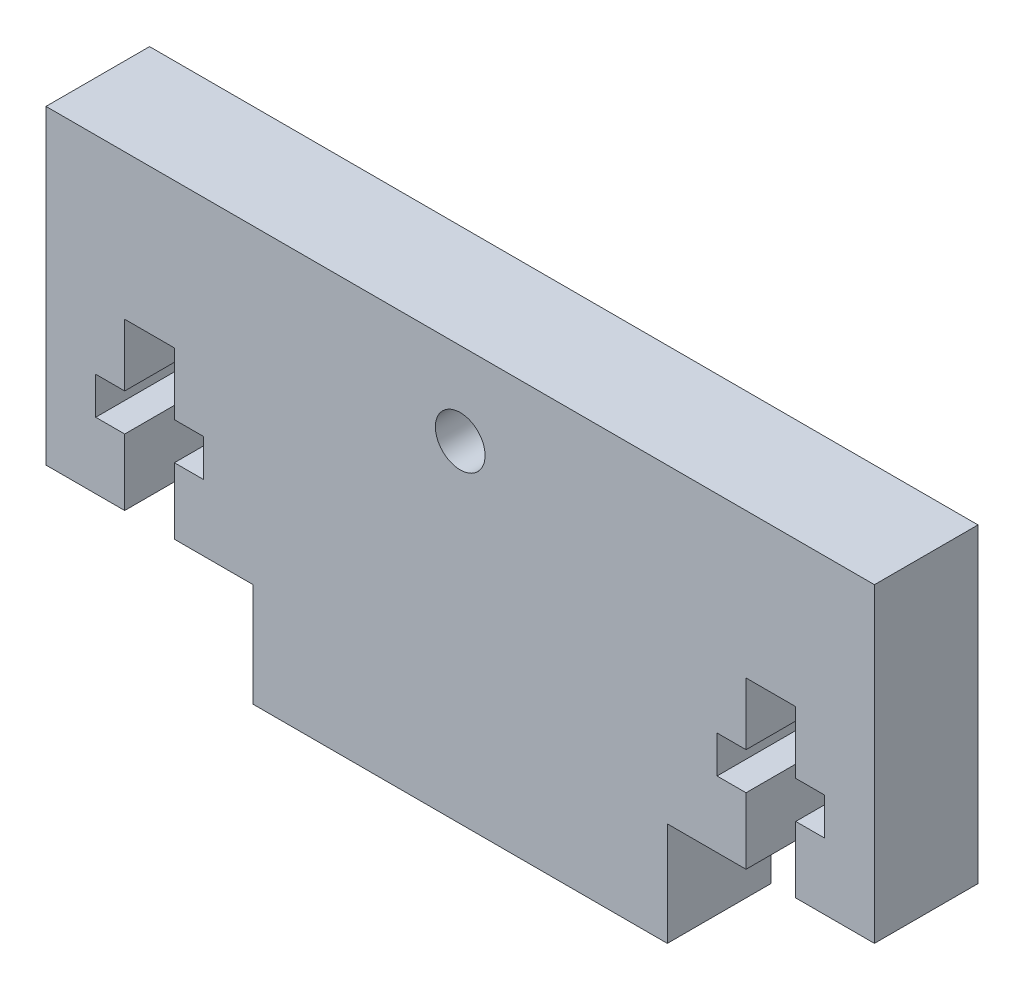
ISO-10303-21;
HEADER;
FILE_DESCRIPTION(('STEP AP214'),'2;1');
FILE_NAME('part.step','',(''),(''),'','','');
FILE_SCHEMA(('AUTOMOTIVE_DESIGN { 1 0 10303 214 1 1 1 1 }'));
ENDSEC;
DATA;
#1=APPLICATION_CONTEXT('core data for automotive mechanical design processes');
#2=APPLICATION_PROTOCOL_DEFINITION('international standard','automotive_design',2000,#1);
#3=PRODUCT_CONTEXT('',#1,'mechanical');
#4=PRODUCT('Part','Part','',(#3));
#5=PRODUCT_RELATED_PRODUCT_CATEGORY('part','',(#4));
#6=PRODUCT_DEFINITION_FORMATION('','',#4);
#7=PRODUCT_DEFINITION_CONTEXT('part definition',#1,'design');
#8=PRODUCT_DEFINITION('design','',#6,#7);
#9=PRODUCT_DEFINITION_SHAPE('','',#8);
#10=(LENGTH_UNIT() NAMED_UNIT(*) SI_UNIT(.MILLI.,.METRE.));
#11=(NAMED_UNIT(*) PLANE_ANGLE_UNIT() SI_UNIT($,.RADIAN.));
#12=(NAMED_UNIT(*) SI_UNIT($,.STERADIAN.) SOLID_ANGLE_UNIT());
#13=UNCERTAINTY_MEASURE_WITH_UNIT(LENGTH_MEASURE(1.E-05),#10,'distance_accuracy_value','');
#14=(GEOMETRIC_REPRESENTATION_CONTEXT(3) GLOBAL_UNCERTAINTY_ASSIGNED_CONTEXT((#13)) GLOBAL_UNIT_ASSIGNED_CONTEXT((#10,
#11,#12)) REPRESENTATION_CONTEXT('',''));
#15=CARTESIAN_POINT('',(0.,0.,0.));
#16=DIRECTION('',(0.,0.,1.));
#17=DIRECTION('',(1.,0.,0.));
#18=AXIS2_PLACEMENT_3D('',#15,#16,#17);
#19=CARTESIAN_POINT('',(0.,0.,6.35));
#20=DIRECTION('',(0.,1.,0.));
#21=DIRECTION('',(0.,0.,1.));
#22=AXIS2_PLACEMENT_3D('',#19,#20,#21);
#23=PLANE('',#22);
#24=DIRECTION('',(1.,0.,0.));
#25=VECTOR('',#24,1.);
#26=CARTESIAN_POINT('',(0.,0.,0.));
#27=LINE('',#26,#25);
#28=CARTESIAN_POINT('',(12.7,0.,0.));
#29=VERTEX_POINT('',#28);
#30=CARTESIAN_POINT('',(38.1,0.,0.));
#31=VERTEX_POINT('',#30);
#32=EDGE_CURVE('E340',#29,#31,#27,.T.);
#33=ORIENTED_EDGE('',*,*,#32,.T.);
#34=DIRECTION('',(0.,0.,-1.));
#35=VECTOR('',#34,1.);
#36=CARTESIAN_POINT('',(38.1,0.,6.35));
#37=LINE('',#36,#35);
#38=CARTESIAN_POINT('',(38.1,0.,6.35));
#39=VERTEX_POINT('',#38);
#40=EDGE_CURVE('E11',#39,#31,#37,.T.);
#41=ORIENTED_EDGE('',*,*,#40,.F.);
#42=DIRECTION('',(1.,0.,0.));
#43=VECTOR('',#42,1.);
#44=CARTESIAN_POINT('',(0.,0.,6.35));
#45=LINE('',#44,#43);
#46=CARTESIAN_POINT('',(12.7,0.,6.35));
#47=VERTEX_POINT('',#46);
#48=EDGE_CURVE('E332',#47,#39,#45,.T.);
#49=ORIENTED_EDGE('',*,*,#48,.F.);
#50=DIRECTION('',(0.,0.,-1.));
#51=VECTOR('',#50,1.);
#52=CARTESIAN_POINT('',(12.7,0.,6.35));
#53=LINE('',#52,#51);
#54=EDGE_CURVE('E51',#47,#29,#53,.T.);
#55=ORIENTED_EDGE('',*,*,#54,.T.);
#56=EDGE_LOOP('',(#33,#41,#49,#55));
#57=FACE_BOUND('',#56,.T.);
#58=ADVANCED_FACE('F35',(#57),#23,.F.);
#59=CARTESIAN_POINT('',(38.1,0.,6.35));
#60=DIRECTION('',(-1.,0.,0.));
#61=DIRECTION('',(0.,0.,1.));
#62=AXIS2_PLACEMENT_3D('',#59,#60,#61);
#63=PLANE('',#62);
#64=DIRECTION('',(0.,1.,0.));
#65=VECTOR('',#64,1.);
#66=CARTESIAN_POINT('',(38.1,0.,0.));
#67=LINE('',#66,#65);
#68=CARTESIAN_POINT('',(38.1,6.35000000000001,0.));
#69=VERTEX_POINT('',#68);
#70=EDGE_CURVE('E343',#31,#69,#67,.T.);
#71=ORIENTED_EDGE('',*,*,#70,.T.);
#72=DIRECTION('',(0.,0.,-1.));
#73=VECTOR('',#72,1.);
#74=CARTESIAN_POINT('',(38.1,6.35000000000001,6.35));
#75=LINE('',#74,#73);
#76=CARTESIAN_POINT('',(38.1,6.35000000000001,6.35));
#77=VERTEX_POINT('',#76);
#78=EDGE_CURVE('E43',#77,#69,#75,.T.);
#79=ORIENTED_EDGE('',*,*,#78,.F.);
#80=DIRECTION('',(0.,1.,0.));
#81=VECTOR('',#80,1.);
#82=CARTESIAN_POINT('',(38.1,0.,6.35));
#83=LINE('',#82,#81);
#84=EDGE_CURVE('E162',#39,#77,#83,.T.);
#85=ORIENTED_EDGE('',*,*,#84,.F.);
#86=ORIENTED_EDGE('',*,*,#40,.T.);
#87=EDGE_LOOP('',(#71,#79,#85,#86));
#88=FACE_BOUND('',#87,.T.);
#89=ADVANCED_FACE('F478',(#88),#63,.F.);
#90=CARTESIAN_POINT('',(0.,6.35000000000001,6.35));
#91=DIRECTION('',(0.,-1.,0.));
#92=DIRECTION('',(1.,0.,0.));
#93=AXIS2_PLACEMENT_3D('',#90,#91,#92);
#94=PLANE('',#93);
#95=DIRECTION('',(-1.,0.,0.));
#96=VECTOR('',#95,1.);
#97=CARTESIAN_POINT('',(0.,6.35000000000001,0.));
#98=LINE('',#97,#96);
#99=CARTESIAN_POINT('',(42.926,6.35000000000001,0.));
#100=VERTEX_POINT('',#99);
#101=EDGE_CURVE('E347',#100,#69,#98,.T.);
#102=ORIENTED_EDGE('',*,*,#101,.F.);
#103=DIRECTION('',(0.,0.,-1.));
#104=VECTOR('',#103,1.);
#105=CARTESIAN_POINT('',(42.926,6.35000000000001,6.35));
#106=LINE('',#105,#104);
#107=CARTESIAN_POINT('',(42.926,6.35000000000001,6.35));
#108=VERTEX_POINT('',#107);
#109=EDGE_CURVE('E473',#108,#100,#106,.T.);
#110=ORIENTED_EDGE('',*,*,#109,.F.);
#111=DIRECTION('',(-1.,0.,0.));
#112=VECTOR('',#111,1.);
#113=CARTESIAN_POINT('',(0.,6.35000000000001,6.35));
#114=LINE('',#113,#112);
#115=EDGE_CURVE('E328',#108,#77,#114,.T.);
#116=ORIENTED_EDGE('',*,*,#115,.T.);
#117=ORIENTED_EDGE('',*,*,#78,.T.);
#118=EDGE_LOOP('',(#102,#110,#116,#117));
#119=FACE_BOUND('',#118,.T.);
#120=ADVANCED_FACE('F476',(#119),#94,.T.);
#121=CARTESIAN_POINT('',(42.926,0.,6.35));
#122=DIRECTION('',(-1.,0.,0.));
#123=DIRECTION('',(0.,0.,1.));
#124=AXIS2_PLACEMENT_3D('',#121,#122,#123);
#125=PLANE('',#124);
#126=DIRECTION('',(0.,1.,0.));
#127=VECTOR('',#126,1.);
#128=CARTESIAN_POINT('',(42.926,0.,0.));
#129=LINE('',#128,#127);
#130=CARTESIAN_POINT('',(42.926,10.414,0.));
#131=VERTEX_POINT('',#130);
#132=EDGE_CURVE('E353',#100,#131,#129,.T.);
#133=ORIENTED_EDGE('',*,*,#132,.T.);
#134=DIRECTION('',(0.,0.,-1.));
#135=VECTOR('',#134,1.);
#136=CARTESIAN_POINT('',(42.926,10.414,6.35));
#137=LINE('',#136,#135);
#138=CARTESIAN_POINT('',(42.926,10.414,6.35));
#139=VERTEX_POINT('',#138);
#140=EDGE_CURVE('E471',#139,#131,#137,.T.);
#141=ORIENTED_EDGE('',*,*,#140,.F.);
#142=DIRECTION('',(0.,1.,0.));
#143=VECTOR('',#142,1.);
#144=CARTESIAN_POINT('',(42.926,0.,6.35));
#145=LINE('',#144,#143);
#146=EDGE_CURVE('E326',#108,#139,#145,.T.);
#147=ORIENTED_EDGE('',*,*,#146,.F.);
#148=ORIENTED_EDGE('',*,*,#109,.T.);
#149=EDGE_LOOP('',(#133,#141,#147,#148));
#150=FACE_BOUND('',#149,.T.);
#151=ADVANCED_FACE('F485',(#150),#125,.F.);
#152=CARTESIAN_POINT('',(0.,10.4140000000001,6.35));
#153=DIRECTION('',(0.,1.,0.));
#154=DIRECTION('',(-1.,0.,0.));
#155=AXIS2_PLACEMENT_3D('',#152,#153,#154);
#156=PLANE('',#155);
#157=DIRECTION('',(1.,0.,0.));
#158=VECTOR('',#157,1.);
#159=CARTESIAN_POINT('',(0.,10.4140000000001,0.));
#160=LINE('',#159,#158);
#161=CARTESIAN_POINT('',(41.148,10.414,0.));
#162=VERTEX_POINT('',#161);
#163=EDGE_CURVE('E357',#162,#131,#160,.T.);
#164=ORIENTED_EDGE('',*,*,#163,.F.);
#165=DIRECTION('',(0.,0.,-1.));
#166=VECTOR('',#165,1.);
#167=CARTESIAN_POINT('',(41.148,10.414,6.35));
#168=LINE('',#167,#166);
#169=CARTESIAN_POINT('',(41.148,10.414,6.35));
#170=VERTEX_POINT('',#169);
#171=EDGE_CURVE('E469',#170,#162,#168,.T.);
#172=ORIENTED_EDGE('',*,*,#171,.F.);
#173=DIRECTION('',(1.,0.,0.));
#174=VECTOR('',#173,1.);
#175=CARTESIAN_POINT('',(0.,10.4140000000001,6.35));
#176=LINE('',#175,#174);
#177=EDGE_CURVE('E323',#170,#139,#176,.T.);
#178=ORIENTED_EDGE('',*,*,#177,.T.);
#179=ORIENTED_EDGE('',*,*,#140,.T.);
#180=EDGE_LOOP('',(#164,#172,#178,#179));
#181=FACE_BOUND('',#180,.T.);
#182=ADVANCED_FACE('F502',(#181),#156,.T.);
#183=CARTESIAN_POINT('',(41.148,0.,6.35));
#184=DIRECTION('',(1.,0.,0.));
#185=DIRECTION('',(0.,0.,-1.));
#186=AXIS2_PLACEMENT_3D('',#183,#184,#185);
#187=PLANE('',#186);
#188=DIRECTION('',(0.,-1.,0.));
#189=VECTOR('',#188,1.);
#190=CARTESIAN_POINT('',(41.148,0.,0.));
#191=LINE('',#190,#189);
#192=CARTESIAN_POINT('',(41.148,12.7,0.));
#193=VERTEX_POINT('',#192);
#194=EDGE_CURVE('E361',#193,#162,#191,.T.);
#195=ORIENTED_EDGE('',*,*,#194,.F.);
#196=DIRECTION('',(0.,0.,-1.));
#197=VECTOR('',#196,1.);
#198=CARTESIAN_POINT('',(41.148,12.7,6.35));
#199=LINE('',#198,#197);
#200=CARTESIAN_POINT('',(41.148,12.7,6.35));
#201=VERTEX_POINT('',#200);
#202=EDGE_CURVE('E467',#201,#193,#199,.T.);
#203=ORIENTED_EDGE('',*,*,#202,.F.);
#204=DIRECTION('',(0.,-1.,0.));
#205=VECTOR('',#204,1.);
#206=CARTESIAN_POINT('',(41.148,0.,6.35));
#207=LINE('',#206,#205);
#208=EDGE_CURVE('E320',#201,#170,#207,.T.);
#209=ORIENTED_EDGE('',*,*,#208,.T.);
#210=ORIENTED_EDGE('',*,*,#171,.T.);
#211=EDGE_LOOP('',(#195,#203,#209,#210));
#212=FACE_BOUND('',#211,.T.);
#213=ADVANCED_FACE('F498',(#212),#187,.T.);
#214=CARTESIAN_POINT('',(0.,12.6999999999999,6.35));
#215=DIRECTION('',(0.,1.,0.));
#216=DIRECTION('',(-1.,0.,0.));
#217=AXIS2_PLACEMENT_3D('',#214,#215,#216);
#218=PLANE('',#217);
#219=DIRECTION('',(1.,0.,0.));
#220=VECTOR('',#219,1.);
#221=CARTESIAN_POINT('',(0.,12.6999999999999,0.));
#222=LINE('',#221,#220);
#223=CARTESIAN_POINT('',(42.926,12.7,0.));
#224=VERTEX_POINT('',#223);
#225=EDGE_CURVE('E365',#193,#224,#222,.T.);
#226=ORIENTED_EDGE('',*,*,#225,.T.);
#227=DIRECTION('',(0.,0.,-1.));
#228=VECTOR('',#227,1.);
#229=CARTESIAN_POINT('',(42.926,12.7,6.35));
#230=LINE('',#229,#228);
#231=CARTESIAN_POINT('',(42.926,12.7,6.35));
#232=VERTEX_POINT('',#231);
#233=EDGE_CURVE('E464',#232,#224,#230,.T.);
#234=ORIENTED_EDGE('',*,*,#233,.F.);
#235=DIRECTION('',(1.,0.,0.));
#236=VECTOR('',#235,1.);
#237=CARTESIAN_POINT('',(0.,12.6999999999999,6.35));
#238=LINE('',#237,#236);
#239=EDGE_CURVE('E318',#201,#232,#238,.T.);
#240=ORIENTED_EDGE('',*,*,#239,.F.);
#241=ORIENTED_EDGE('',*,*,#202,.T.);
#242=EDGE_LOOP('',(#226,#234,#240,#241));
#243=FACE_BOUND('',#242,.T.);
#244=ADVANCED_FACE('F501',(#243),#218,.F.);
#245=CARTESIAN_POINT('',(42.926,16.51,0.));
#246=VERTEX_POINT('',#245);
#247=EDGE_CURVE('E358',#224,#246,#129,.T.);
#248=ORIENTED_EDGE('',*,*,#247,.T.);
#249=DIRECTION('',(0.,0.,-1.));
#250=VECTOR('',#249,1.);
#251=CARTESIAN_POINT('',(42.926,16.51,6.35));
#252=LINE('',#251,#250);
#253=CARTESIAN_POINT('',(42.926,16.51,6.35));
#254=VERTEX_POINT('',#253);
#255=EDGE_CURVE('E461',#254,#246,#252,.T.);
#256=ORIENTED_EDGE('',*,*,#255,.F.);
#257=EDGE_CURVE('E317',#232,#254,#145,.T.);
#258=ORIENTED_EDGE('',*,*,#257,.F.);
#259=ORIENTED_EDGE('',*,*,#233,.T.);
#260=EDGE_LOOP('',(#248,#256,#258,#259));
#261=FACE_BOUND('',#260,.T.);
#262=ADVANCED_FACE('F504',(#261),#125,.F.);
#263=CARTESIAN_POINT('',(0.,16.51,6.35));
#264=DIRECTION('',(0.,1.,0.));
#265=DIRECTION('',(0.,0.,1.));
#266=AXIS2_PLACEMENT_3D('',#263,#264,#265);
#267=PLANE('',#266);
#268=DIRECTION('',(1.,0.,0.));
#269=VECTOR('',#268,1.);
#270=CARTESIAN_POINT('',(0.,16.51,0.));
#271=LINE('',#270,#269);
#272=CARTESIAN_POINT('',(45.974,16.51,0.));
#273=VERTEX_POINT('',#272);
#274=EDGE_CURVE('E368',#246,#273,#271,.T.);
#275=ORIENTED_EDGE('',*,*,#274,.T.);
#276=DIRECTION('',(0.,0.,-1.));
#277=VECTOR('',#276,1.);
#278=CARTESIAN_POINT('',(45.974,16.51,6.35));
#279=LINE('',#278,#277);
#280=CARTESIAN_POINT('',(45.974,16.51,6.35));
#281=VERTEX_POINT('',#280);
#282=EDGE_CURVE('E459',#281,#273,#279,.T.);
#283=ORIENTED_EDGE('',*,*,#282,.F.);
#284=DIRECTION('',(1.,0.,0.));
#285=VECTOR('',#284,1.);
#286=CARTESIAN_POINT('',(0.,16.51,6.35));
#287=LINE('',#286,#285);
#288=EDGE_CURVE('E314',#254,#281,#287,.T.);
#289=ORIENTED_EDGE('',*,*,#288,.F.);
#290=ORIENTED_EDGE('',*,*,#255,.T.);
#291=EDGE_LOOP('',(#275,#283,#289,#290));
#292=FACE_BOUND('',#291,.T.);
#293=ADVANCED_FACE('F507',(#292),#267,.F.);
#294=CARTESIAN_POINT('',(45.974,0.,6.35));
#295=DIRECTION('',(-1.,0.,0.));
#296=DIRECTION('',(0.,0.,1.));
#297=AXIS2_PLACEMENT_3D('',#294,#295,#296);
#298=PLANE('',#297);
#299=DIRECTION('',(0.,1.,0.));
#300=VECTOR('',#299,1.);
#301=CARTESIAN_POINT('',(45.974,0.,0.));
#302=LINE('',#301,#300);
#303=CARTESIAN_POINT('',(45.974,12.7,0.));
#304=VERTEX_POINT('',#303);
#305=EDGE_CURVE('E371',#304,#273,#302,.T.);
#306=ORIENTED_EDGE('',*,*,#305,.F.);
#307=DIRECTION('',(0.,0.,-1.));
#308=VECTOR('',#307,1.);
#309=CARTESIAN_POINT('',(45.974,12.7,6.35));
#310=LINE('',#309,#308);
#311=CARTESIAN_POINT('',(45.974,12.7,6.35));
#312=VERTEX_POINT('',#311);
#313=EDGE_CURVE('E457',#312,#304,#310,.T.);
#314=ORIENTED_EDGE('',*,*,#313,.F.);
#315=DIRECTION('',(0.,1.,0.));
#316=VECTOR('',#315,1.);
#317=CARTESIAN_POINT('',(45.974,0.,6.35));
#318=LINE('',#317,#316);
#319=EDGE_CURVE('E311',#312,#281,#318,.T.);
#320=ORIENTED_EDGE('',*,*,#319,.T.);
#321=ORIENTED_EDGE('',*,*,#282,.T.);
#322=EDGE_LOOP('',(#306,#314,#320,#321));
#323=FACE_BOUND('',#322,.T.);
#324=ADVANCED_FACE('F511',(#323),#298,.T.);
#325=CARTESIAN_POINT('',(47.752,12.7,0.));
#326=VERTEX_POINT('',#325);
#327=EDGE_CURVE('E367',#304,#326,#222,.T.);
#328=ORIENTED_EDGE('',*,*,#327,.T.);
#329=DIRECTION('',(0.,0.,-1.));
#330=VECTOR('',#329,1.);
#331=CARTESIAN_POINT('',(47.752,12.7,6.35));
#332=LINE('',#331,#330);
#333=CARTESIAN_POINT('',(47.752,12.7,6.35));
#334=VERTEX_POINT('',#333);
#335=EDGE_CURVE('E454',#334,#326,#332,.T.);
#336=ORIENTED_EDGE('',*,*,#335,.F.);
#337=EDGE_CURVE('E310',#312,#334,#238,.T.);
#338=ORIENTED_EDGE('',*,*,#337,.F.);
#339=ORIENTED_EDGE('',*,*,#313,.T.);
#340=EDGE_LOOP('',(#328,#336,#338,#339));
#341=FACE_BOUND('',#340,.T.);
#342=ADVANCED_FACE('F513',(#341),#218,.F.);
#343=CARTESIAN_POINT('',(47.752,0.,6.35));
#344=DIRECTION('',(1.,0.,0.));
#345=DIRECTION('',(0.,0.,-1.));
#346=AXIS2_PLACEMENT_3D('',#343,#344,#345);
#347=PLANE('',#346);
#348=DIRECTION('',(0.,-1.,0.));
#349=VECTOR('',#348,1.);
#350=CARTESIAN_POINT('',(47.752,0.,0.));
#351=LINE('',#350,#349);
#352=CARTESIAN_POINT('',(47.752,10.414,0.));
#353=VERTEX_POINT('',#352);
#354=EDGE_CURVE('E375',#326,#353,#351,.T.);
#355=ORIENTED_EDGE('',*,*,#354,.T.);
#356=DIRECTION('',(0.,0.,-1.));
#357=VECTOR('',#356,1.);
#358=CARTESIAN_POINT('',(47.752,10.414,6.35));
#359=LINE('',#358,#357);
#360=CARTESIAN_POINT('',(47.752,10.414,6.35));
#361=VERTEX_POINT('',#360);
#362=EDGE_CURVE('E452',#361,#353,#359,.T.);
#363=ORIENTED_EDGE('',*,*,#362,.F.);
#364=DIRECTION('',(0.,-1.,0.));
#365=VECTOR('',#364,1.);
#366=CARTESIAN_POINT('',(47.752,0.,6.35));
#367=LINE('',#366,#365);
#368=EDGE_CURVE('E307',#334,#361,#367,.T.);
#369=ORIENTED_EDGE('',*,*,#368,.F.);
#370=ORIENTED_EDGE('',*,*,#335,.T.);
#371=EDGE_LOOP('',(#355,#363,#369,#370));
#372=FACE_BOUND('',#371,.T.);
#373=ADVANCED_FACE('F516',(#372),#347,.F.);
#374=CARTESIAN_POINT('',(45.974,10.414,0.));
#375=VERTEX_POINT('',#374);
#376=EDGE_CURVE('E362',#375,#353,#160,.T.);
#377=ORIENTED_EDGE('',*,*,#376,.F.);
#378=DIRECTION('',(0.,0.,-1.));
#379=VECTOR('',#378,1.);
#380=CARTESIAN_POINT('',(45.974,10.414,6.35));
#381=LINE('',#380,#379);
#382=CARTESIAN_POINT('',(45.974,10.414,6.35));
#383=VERTEX_POINT('',#382);
#384=EDGE_CURVE('E450',#383,#375,#381,.T.);
#385=ORIENTED_EDGE('',*,*,#384,.F.);
#386=EDGE_CURVE('E309',#383,#361,#176,.T.);
#387=ORIENTED_EDGE('',*,*,#386,.T.);
#388=ORIENTED_EDGE('',*,*,#362,.T.);
#389=EDGE_LOOP('',(#377,#385,#387,#388));
#390=FACE_BOUND('',#389,.T.);
#391=ADVANCED_FACE('F520',(#390),#156,.T.);
#392=CARTESIAN_POINT('',(45.974,6.35000000000001,0.));
#393=VERTEX_POINT('',#392);
#394=EDGE_CURVE('E374',#393,#375,#302,.T.);
#395=ORIENTED_EDGE('',*,*,#394,.F.);
#396=DIRECTION('',(0.,0.,-1.));
#397=VECTOR('',#396,1.);
#398=CARTESIAN_POINT('',(45.974,6.35000000000001,6.35));
#399=LINE('',#398,#397);
#400=CARTESIAN_POINT('',(45.974,6.35000000000001,6.35));
#401=VERTEX_POINT('',#400);
#402=EDGE_CURVE('E448',#401,#393,#399,.T.);
#403=ORIENTED_EDGE('',*,*,#402,.F.);
#404=EDGE_CURVE('E315',#401,#383,#318,.T.);
#405=ORIENTED_EDGE('',*,*,#404,.T.);
#406=ORIENTED_EDGE('',*,*,#384,.T.);
#407=EDGE_LOOP('',(#395,#403,#405,#406));
#408=FACE_BOUND('',#407,.T.);
#409=ADVANCED_FACE('F524',(#408),#298,.T.);
#410=CARTESIAN_POINT('',(50.8,6.35000000000001,0.));
#411=VERTEX_POINT('',#410);
#412=EDGE_CURVE('E354',#411,#393,#98,.T.);
#413=ORIENTED_EDGE('',*,*,#412,.F.);
#414=DIRECTION('',(0.,0.,-1.));
#415=VECTOR('',#414,1.);
#416=CARTESIAN_POINT('',(50.8,6.35000000000001,6.35));
#417=LINE('',#416,#415);
#418=CARTESIAN_POINT('',(50.8,6.35000000000001,6.35));
#419=VERTEX_POINT('',#418);
#420=EDGE_CURVE('E446',#419,#411,#417,.T.);
#421=ORIENTED_EDGE('',*,*,#420,.F.);
#422=EDGE_CURVE('E306',#419,#401,#114,.T.);
#423=ORIENTED_EDGE('',*,*,#422,.T.);
#424=ORIENTED_EDGE('',*,*,#402,.T.);
#425=EDGE_LOOP('',(#413,#421,#423,#424));
#426=FACE_BOUND('',#425,.T.);
#427=ADVANCED_FACE('F496',(#426),#94,.T.);
#428=CARTESIAN_POINT('',(50.8,0.,6.35));
#429=DIRECTION('',(1.,0.,0.));
#430=DIRECTION('',(0.,1.,0.));
#431=AXIS2_PLACEMENT_3D('',#428,#429,#430);
#432=PLANE('',#431);
#433=DIRECTION('',(0.,-1.,0.));
#434=VECTOR('',#433,1.);
#435=CARTESIAN_POINT('',(50.8,0.,0.));
#436=LINE('',#435,#434);
#437=CARTESIAN_POINT('',(50.8,25.4,0.));
#438=VERTEX_POINT('',#437);
#439=EDGE_CURVE('E378',#438,#411,#436,.T.);
#440=ORIENTED_EDGE('',*,*,#439,.F.);
#441=DIRECTION('',(0.,0.,-1.));
#442=VECTOR('',#441,1.);
#443=CARTESIAN_POINT('',(50.8,25.4,6.35));
#444=LINE('',#443,#442);
#445=CARTESIAN_POINT('',(50.8,25.4,6.35));
#446=VERTEX_POINT('',#445);
#447=EDGE_CURVE('E444',#446,#438,#444,.T.);
#448=ORIENTED_EDGE('',*,*,#447,.F.);
#449=DIRECTION('',(0.,-1.,0.));
#450=VECTOR('',#449,1.);
#451=CARTESIAN_POINT('',(50.8,0.,6.35));
#452=LINE('',#451,#450);
#453=EDGE_CURVE('E303',#446,#419,#452,.T.);
#454=ORIENTED_EDGE('',*,*,#453,.T.);
#455=ORIENTED_EDGE('',*,*,#420,.T.);
#456=EDGE_LOOP('',(#440,#448,#454,#455));
#457=FACE_BOUND('',#456,.T.);
#458=ADVANCED_FACE('F530',(#457),#432,.T.);
#459=CARTESIAN_POINT('',(0.,25.4,6.35));
#460=DIRECTION('',(0.,1.,0.));
#461=DIRECTION('',(-1.,0.,0.));
#462=AXIS2_PLACEMENT_3D('',#459,#460,#461);
#463=PLANE('',#462);
#464=DIRECTION('',(1.,0.,0.));
#465=VECTOR('',#464,1.);
#466=CARTESIAN_POINT('',(0.,25.4,0.));
#467=LINE('',#466,#465);
#468=CARTESIAN_POINT('',(0.,25.4,0.));
#469=VERTEX_POINT('',#468);
#470=EDGE_CURVE('E381',#469,#438,#467,.T.);
#471=ORIENTED_EDGE('',*,*,#470,.F.);
#472=DIRECTION('',(0.,0.,-1.));
#473=VECTOR('',#472,1.);
#474=CARTESIAN_POINT('',(0.,25.4,6.35));
#475=LINE('',#474,#473);
#476=CARTESIAN_POINT('',(0.,25.4,6.35));
#477=VERTEX_POINT('',#476);
#478=EDGE_CURVE('E442',#477,#469,#475,.T.);
#479=ORIENTED_EDGE('',*,*,#478,.F.);
#480=DIRECTION('',(1.,0.,0.));
#481=VECTOR('',#480,1.);
#482=CARTESIAN_POINT('',(0.,25.4,6.35));
#483=LINE('',#482,#481);
#484=EDGE_CURVE('E300',#477,#446,#483,.T.);
#485=ORIENTED_EDGE('',*,*,#484,.T.);
#486=ORIENTED_EDGE('',*,*,#447,.T.);
#487=EDGE_LOOP('',(#471,#479,#485,#486));
#488=FACE_BOUND('',#487,.T.);
#489=ADVANCED_FACE('F534',(#488),#463,.T.);
#490=CARTESIAN_POINT('',(0.,0.,6.35));
#491=DIRECTION('',(1.,0.,0.));
#492=DIRECTION('',(0.,1.,0.));
#493=AXIS2_PLACEMENT_3D('',#490,#491,#492);
#494=PLANE('',#493);
#495=DIRECTION('',(0.,-1.,0.));
#496=VECTOR('',#495,1.);
#497=CARTESIAN_POINT('',(0.,0.,0.));
#498=LINE('',#497,#496);
#499=CARTESIAN_POINT('',(0.,6.35000000000001,0.));
#500=VERTEX_POINT('',#499);
#501=EDGE_CURVE('E384',#469,#500,#498,.T.);
#502=ORIENTED_EDGE('',*,*,#501,.T.);
#503=DIRECTION('',(0.,0.,-1.));
#504=VECTOR('',#503,1.);
#505=CARTESIAN_POINT('',(0.,6.35000000000001,6.35));
#506=LINE('',#505,#504);
#507=CARTESIAN_POINT('',(0.,6.35000000000001,6.35));
#508=VERTEX_POINT('',#507);
#509=EDGE_CURVE('E439',#508,#500,#506,.T.);
#510=ORIENTED_EDGE('',*,*,#509,.F.);
#511=DIRECTION('',(0.,-1.,0.));
#512=VECTOR('',#511,1.);
#513=CARTESIAN_POINT('',(0.,0.,6.35));
#514=LINE('',#513,#512);
#515=EDGE_CURVE('E298',#477,#508,#514,.T.);
#516=ORIENTED_EDGE('',*,*,#515,.F.);
#517=ORIENTED_EDGE('',*,*,#478,.T.);
#518=EDGE_LOOP('',(#502,#510,#516,#517));
#519=FACE_BOUND('',#518,.T.);
#520=ADVANCED_FACE('F538',(#519),#494,.F.);
#521=CARTESIAN_POINT('',(0.,6.35000000000001,6.35));
#522=DIRECTION('',(0.,1.,0.));
#523=DIRECTION('',(-1.,0.,0.));
#524=AXIS2_PLACEMENT_3D('',#521,#522,#523);
#525=PLANE('',#524);
#526=DIRECTION('',(1.,0.,0.));
#527=VECTOR('',#526,1.);
#528=CARTESIAN_POINT('',(0.,6.35000000000001,0.));
#529=LINE('',#528,#527);
#530=CARTESIAN_POINT('',(4.82599999999998,6.35000000000001,0.));
#531=VERTEX_POINT('',#530);
#532=EDGE_CURVE('E386',#500,#531,#529,.T.);
#533=ORIENTED_EDGE('',*,*,#532,.T.);
#534=DIRECTION('',(0.,0.,-1.));
#535=VECTOR('',#534,1.);
#536=CARTESIAN_POINT('',(4.82599999999998,6.35000000000001,6.35));
#537=LINE('',#536,#535);
#538=CARTESIAN_POINT('',(4.82599999999998,6.35000000000001,6.35));
#539=VERTEX_POINT('',#538);
#540=EDGE_CURVE('E436',#539,#531,#537,.T.);
#541=ORIENTED_EDGE('',*,*,#540,.F.);
#542=DIRECTION('',(1.,0.,0.));
#543=VECTOR('',#542,1.);
#544=CARTESIAN_POINT('',(0.,6.35000000000001,6.35));
#545=LINE('',#544,#543);
#546=EDGE_CURVE('E267',#508,#539,#545,.T.);
#547=ORIENTED_EDGE('',*,*,#546,.F.);
#548=ORIENTED_EDGE('',*,*,#509,.T.);
#549=EDGE_LOOP('',(#533,#541,#547,#548));
#550=FACE_BOUND('',#549,.T.);
#551=ADVANCED_FACE('F542',(#550),#525,.F.);
#552=CARTESIAN_POINT('',(4.82599999999998,0.,6.35));
#553=DIRECTION('',(-1.,0.,0.));
#554=DIRECTION('',(0.,0.,1.));
#555=AXIS2_PLACEMENT_3D('',#552,#553,#554);
#556=PLANE('',#555);
#557=DIRECTION('',(0.,1.,0.));
#558=VECTOR('',#557,1.);
#559=CARTESIAN_POINT('',(4.82599999999998,0.,0.));
#560=LINE('',#559,#558);
#561=CARTESIAN_POINT('',(4.82599999999998,10.414,0.));
#562=VERTEX_POINT('',#561);
#563=EDGE_CURVE('E388',#531,#562,#560,.T.);
#564=ORIENTED_EDGE('',*,*,#563,.T.);
#565=DIRECTION('',(0.,0.,-1.));
#566=VECTOR('',#565,1.);
#567=CARTESIAN_POINT('',(4.82599999999998,10.414,6.35));
#568=LINE('',#567,#566);
#569=CARTESIAN_POINT('',(4.82599999999998,10.414,6.35));
#570=VERTEX_POINT('',#569);
#571=EDGE_CURVE('E433',#570,#562,#568,.T.);
#572=ORIENTED_EDGE('',*,*,#571,.F.);
#573=DIRECTION('',(0.,1.,0.));
#574=VECTOR('',#573,1.);
#575=CARTESIAN_POINT('',(4.82599999999998,0.,6.35));
#576=LINE('',#575,#574);
#577=EDGE_CURVE('E292',#539,#570,#576,.T.);
#578=ORIENTED_EDGE('',*,*,#577,.F.);
#579=ORIENTED_EDGE('',*,*,#540,.T.);
#580=EDGE_LOOP('',(#564,#572,#578,#579));
#581=FACE_BOUND('',#580,.T.);
#582=ADVANCED_FACE('F555',(#581),#556,.F.);
#583=CARTESIAN_POINT('',(0.,10.414,6.35));
#584=DIRECTION('',(0.,-1.,0.));
#585=DIRECTION('',(1.,0.,0.));
#586=AXIS2_PLACEMENT_3D('',#583,#584,#585);
#587=PLANE('',#586);
#588=DIRECTION('',(-1.,0.,0.));
#589=VECTOR('',#588,1.);
#590=CARTESIAN_POINT('',(0.,10.414,0.));
#591=LINE('',#590,#589);
#592=CARTESIAN_POINT('',(3.04799999999998,10.414,0.));
#593=VERTEX_POINT('',#592);
#594=EDGE_CURVE('E391',#562,#593,#591,.T.);
#595=ORIENTED_EDGE('',*,*,#594,.T.);
#596=DIRECTION('',(0.,0.,-1.));
#597=VECTOR('',#596,1.);
#598=CARTESIAN_POINT('',(3.04799999999998,10.414,6.35));
#599=LINE('',#598,#597);
#600=CARTESIAN_POINT('',(3.04799999999998,10.414,6.35));
#601=VERTEX_POINT('',#600);
#602=EDGE_CURVE('E431',#601,#593,#599,.T.);
#603=ORIENTED_EDGE('',*,*,#602,.F.);
#604=DIRECTION('',(-1.,0.,0.));
#605=VECTOR('',#604,1.);
#606=CARTESIAN_POINT('',(0.,10.414,6.35));
#607=LINE('',#606,#605);
#608=EDGE_CURVE('E276',#570,#601,#607,.T.);
#609=ORIENTED_EDGE('',*,*,#608,.F.);
#610=ORIENTED_EDGE('',*,*,#571,.T.);
#611=EDGE_LOOP('',(#595,#603,#609,#610));
#612=FACE_BOUND('',#611,.T.);
#613=ADVANCED_FACE('F548',(#612),#587,.F.);
#614=CARTESIAN_POINT('',(3.04799999999998,0.,6.35));
#615=DIRECTION('',(1.,0.,0.));
#616=DIRECTION('',(0.,0.,-1.));
#617=AXIS2_PLACEMENT_3D('',#614,#615,#616);
#618=PLANE('',#617);
#619=DIRECTION('',(0.,-1.,0.));
#620=VECTOR('',#619,1.);
#621=CARTESIAN_POINT('',(3.04799999999998,0.,0.));
#622=LINE('',#621,#620);
#623=CARTESIAN_POINT('',(3.04799999999998,12.7,0.));
#624=VERTEX_POINT('',#623);
#625=EDGE_CURVE('E395',#624,#593,#622,.T.);
#626=ORIENTED_EDGE('',*,*,#625,.F.);
#627=DIRECTION('',(0.,0.,-1.));
#628=VECTOR('',#627,1.);
#629=CARTESIAN_POINT('',(3.04799999999998,12.7,6.35));
#630=LINE('',#629,#628);
#631=CARTESIAN_POINT('',(3.04799999999998,12.7,6.35));
#632=VERTEX_POINT('',#631);
#633=EDGE_CURVE('E429',#632,#624,#630,.T.);
#634=ORIENTED_EDGE('',*,*,#633,.F.);
#635=DIRECTION('',(0.,-1.,0.));
#636=VECTOR('',#635,1.);
#637=CARTESIAN_POINT('',(3.04799999999998,0.,6.35));
#638=LINE('',#637,#636);
#639=EDGE_CURVE('E295',#632,#601,#638,.T.);
#640=ORIENTED_EDGE('',*,*,#639,.T.);
#641=ORIENTED_EDGE('',*,*,#602,.T.);
#642=EDGE_LOOP('',(#626,#634,#640,#641));
#643=FACE_BOUND('',#642,.T.);
#644=ADVANCED_FACE('F544',(#643),#618,.T.);
#645=CARTESIAN_POINT('',(0.,12.7,6.35));
#646=DIRECTION('',(0.,-1.,0.));
#647=DIRECTION('',(1.,0.,0.));
#648=AXIS2_PLACEMENT_3D('',#645,#646,#647);
#649=PLANE('',#648);
#650=DIRECTION('',(-1.,0.,0.));
#651=VECTOR('',#650,1.);
#652=CARTESIAN_POINT('',(0.,12.7,0.));
#653=LINE('',#652,#651);
#654=CARTESIAN_POINT('',(4.82599999999998,12.7,0.));
#655=VERTEX_POINT('',#654);
#656=EDGE_CURVE('E399',#655,#624,#653,.T.);
#657=ORIENTED_EDGE('',*,*,#656,.F.);
#658=DIRECTION('',(0.,0.,-1.));
#659=VECTOR('',#658,1.);
#660=CARTESIAN_POINT('',(4.82599999999998,12.7,6.35));
#661=LINE('',#660,#659);
#662=CARTESIAN_POINT('',(4.82599999999998,12.7,6.35));
#663=VERTEX_POINT('',#662);
#664=EDGE_CURVE('E427',#663,#655,#661,.T.);
#665=ORIENTED_EDGE('',*,*,#664,.F.);
#666=DIRECTION('',(-1.,0.,0.));
#667=VECTOR('',#666,1.);
#668=CARTESIAN_POINT('',(0.,12.7,6.35));
#669=LINE('',#668,#667);
#670=EDGE_CURVE('E286',#663,#632,#669,.T.);
#671=ORIENTED_EDGE('',*,*,#670,.T.);
#672=ORIENTED_EDGE('',*,*,#633,.T.);
#673=EDGE_LOOP('',(#657,#665,#671,#672));
#674=FACE_BOUND('',#673,.T.);
#675=ADVANCED_FACE('F547',(#674),#649,.T.);
#676=CARTESIAN_POINT('',(4.82599999999998,16.51,0.));
#677=VERTEX_POINT('',#676);
#678=EDGE_CURVE('E392',#655,#677,#560,.T.);
#679=ORIENTED_EDGE('',*,*,#678,.T.);
#680=DIRECTION('',(0.,0.,-1.));
#681=VECTOR('',#680,1.);
#682=CARTESIAN_POINT('',(4.82599999999998,16.51,6.35));
#683=LINE('',#682,#681);
#684=CARTESIAN_POINT('',(4.82599999999998,16.51,6.35));
#685=VERTEX_POINT('',#684);
#686=EDGE_CURVE('E425',#685,#677,#683,.T.);
#687=ORIENTED_EDGE('',*,*,#686,.F.);
#688=EDGE_CURVE('E288',#663,#685,#576,.T.);
#689=ORIENTED_EDGE('',*,*,#688,.F.);
#690=ORIENTED_EDGE('',*,*,#664,.T.);
#691=EDGE_LOOP('',(#679,#687,#689,#690));
#692=FACE_BOUND('',#691,.T.);
#693=ADVANCED_FACE('F550',(#692),#556,.F.);
#694=CARTESIAN_POINT('',(0.,16.51,6.35));
#695=DIRECTION('',(0.,-1.,0.));
#696=DIRECTION('',(0.,0.,-1.));
#697=AXIS2_PLACEMENT_3D('',#694,#695,#696);
#698=PLANE('',#697);
#699=DIRECTION('',(-1.,0.,0.));
#700=VECTOR('',#699,1.);
#701=CARTESIAN_POINT('',(0.,16.51,0.));
#702=LINE('',#701,#700);
#703=CARTESIAN_POINT('',(7.87399999999999,16.51,0.));
#704=VERTEX_POINT('',#703);
#705=EDGE_CURVE('E403',#704,#677,#702,.T.);
#706=ORIENTED_EDGE('',*,*,#705,.F.);
#707=DIRECTION('',(0.,0.,-1.));
#708=VECTOR('',#707,1.);
#709=CARTESIAN_POINT('',(7.87399999999999,16.51,6.35));
#710=LINE('',#709,#708);
#711=CARTESIAN_POINT('',(7.87399999999999,16.51,6.35));
#712=VERTEX_POINT('',#711);
#713=EDGE_CURVE('E423',#712,#704,#710,.T.);
#714=ORIENTED_EDGE('',*,*,#713,.F.);
#715=DIRECTION('',(-1.,0.,0.));
#716=VECTOR('',#715,1.);
#717=CARTESIAN_POINT('',(0.,16.51,6.35));
#718=LINE('',#717,#716);
#719=EDGE_CURVE('E281',#712,#685,#718,.T.);
#720=ORIENTED_EDGE('',*,*,#719,.T.);
#721=ORIENTED_EDGE('',*,*,#686,.T.);
#722=EDGE_LOOP('',(#706,#714,#720,#721));
#723=FACE_BOUND('',#722,.T.);
#724=ADVANCED_FACE('F553',(#723),#698,.T.);
#725=CARTESIAN_POINT('',(7.87399999999999,0.,6.35));
#726=DIRECTION('',(-1.,0.,0.));
#727=DIRECTION('',(0.,0.,1.));
#728=AXIS2_PLACEMENT_3D('',#725,#726,#727);
#729=PLANE('',#728);
#730=DIRECTION('',(0.,1.,0.));
#731=VECTOR('',#730,1.);
#732=CARTESIAN_POINT('',(7.87399999999999,0.,0.));
#733=LINE('',#732,#731);
#734=CARTESIAN_POINT('',(7.87399999999999,12.7,0.));
#735=VERTEX_POINT('',#734);
#736=EDGE_CURVE('E406',#735,#704,#733,.T.);
#737=ORIENTED_EDGE('',*,*,#736,.F.);
#738=DIRECTION('',(0.,0.,-1.));
#739=VECTOR('',#738,1.);
#740=CARTESIAN_POINT('',(7.87399999999999,12.7,6.35));
#741=LINE('',#740,#739);
#742=CARTESIAN_POINT('',(7.87399999999999,12.7,6.35));
#743=VERTEX_POINT('',#742);
#744=EDGE_CURVE('E421',#743,#735,#741,.T.);
#745=ORIENTED_EDGE('',*,*,#744,.F.);
#746=DIRECTION('',(0.,1.,0.));
#747=VECTOR('',#746,1.);
#748=CARTESIAN_POINT('',(7.87399999999999,0.,6.35));
#749=LINE('',#748,#747);
#750=EDGE_CURVE('E273',#743,#712,#749,.T.);
#751=ORIENTED_EDGE('',*,*,#750,.T.);
#752=ORIENTED_EDGE('',*,*,#713,.T.);
#753=EDGE_LOOP('',(#737,#745,#751,#752));
#754=FACE_BOUND('',#753,.T.);
#755=ADVANCED_FACE('F558',(#754),#729,.T.);
#756=CARTESIAN_POINT('',(9.65199999999998,12.7,0.));
#757=VERTEX_POINT('',#756);
#758=EDGE_CURVE('E402',#757,#735,#653,.T.);
#759=ORIENTED_EDGE('',*,*,#758,.F.);
#760=DIRECTION('',(0.,0.,-1.));
#761=VECTOR('',#760,1.);
#762=CARTESIAN_POINT('',(9.65199999999998,12.7,6.35));
#763=LINE('',#762,#761);
#764=CARTESIAN_POINT('',(9.65199999999998,12.7,6.35));
#765=VERTEX_POINT('',#764);
#766=EDGE_CURVE('E419',#765,#757,#763,.T.);
#767=ORIENTED_EDGE('',*,*,#766,.F.);
#768=EDGE_CURVE('E280',#765,#743,#669,.T.);
#769=ORIENTED_EDGE('',*,*,#768,.T.);
#770=ORIENTED_EDGE('',*,*,#744,.T.);
#771=EDGE_LOOP('',(#759,#767,#769,#770));
#772=FACE_BOUND('',#771,.T.);
#773=ADVANCED_FACE('F559',(#772),#649,.T.);
#774=CARTESIAN_POINT('',(9.65199999999998,0.,6.35));
#775=DIRECTION('',(1.,0.,0.));
#776=DIRECTION('',(0.,0.,-1.));
#777=AXIS2_PLACEMENT_3D('',#774,#775,#776);
#778=PLANE('',#777);
#779=DIRECTION('',(0.,-1.,0.));
#780=VECTOR('',#779,1.);
#781=CARTESIAN_POINT('',(9.65199999999998,0.,0.));
#782=LINE('',#781,#780);
#783=CARTESIAN_POINT('',(9.65199999999998,10.414,0.));
#784=VERTEX_POINT('',#783);
#785=EDGE_CURVE('E409',#757,#784,#782,.T.);
#786=ORIENTED_EDGE('',*,*,#785,.T.);
#787=DIRECTION('',(0.,0.,-1.));
#788=VECTOR('',#787,1.);
#789=CARTESIAN_POINT('',(9.65199999999998,10.414,6.35));
#790=LINE('',#789,#788);
#791=CARTESIAN_POINT('',(9.65199999999998,10.414,6.35));
#792=VERTEX_POINT('',#791);
#793=EDGE_CURVE('E416',#792,#784,#790,.T.);
#794=ORIENTED_EDGE('',*,*,#793,.F.);
#795=DIRECTION('',(0.,-1.,0.));
#796=VECTOR('',#795,1.);
#797=CARTESIAN_POINT('',(9.65199999999998,0.,6.35));
#798=LINE('',#797,#796);
#799=EDGE_CURVE('E274',#765,#792,#798,.T.);
#800=ORIENTED_EDGE('',*,*,#799,.F.);
#801=ORIENTED_EDGE('',*,*,#766,.T.);
#802=EDGE_LOOP('',(#786,#794,#800,#801));
#803=FACE_BOUND('',#802,.T.);
#804=ADVANCED_FACE('F562',(#803),#778,.F.);
#805=CARTESIAN_POINT('',(7.87399999999999,10.414,0.));
#806=VERTEX_POINT('',#805);
#807=EDGE_CURVE('E396',#784,#806,#591,.T.);
#808=ORIENTED_EDGE('',*,*,#807,.T.);
#809=DIRECTION('',(0.,0.,-1.));
#810=VECTOR('',#809,1.);
#811=CARTESIAN_POINT('',(7.87399999999999,10.414,6.35));
#812=LINE('',#811,#810);
#813=CARTESIAN_POINT('',(7.87399999999999,10.414,6.35));
#814=VERTEX_POINT('',#813);
#815=EDGE_CURVE('E259',#814,#806,#812,.T.);
#816=ORIENTED_EDGE('',*,*,#815,.F.);
#817=EDGE_CURVE('E270',#792,#814,#607,.T.);
#818=ORIENTED_EDGE('',*,*,#817,.F.);
#819=ORIENTED_EDGE('',*,*,#793,.T.);
#820=EDGE_LOOP('',(#808,#816,#818,#819));
#821=FACE_BOUND('',#820,.T.);
#822=ADVANCED_FACE('F566',(#821),#587,.F.);
#823=CARTESIAN_POINT('',(7.87399999999999,6.35000000000001,0.));
#824=VERTEX_POINT('',#823);
#825=EDGE_CURVE('E256',#824,#806,#733,.T.);
#826=ORIENTED_EDGE('',*,*,#825,.F.);
#827=DIRECTION('',(0.,0.,-1.));
#828=VECTOR('',#827,1.);
#829=CARTESIAN_POINT('',(7.87399999999999,6.35000000000001,6.35));
#830=LINE('',#829,#828);
#831=CARTESIAN_POINT('',(7.87399999999999,6.35000000000001,6.35));
#832=VERTEX_POINT('',#831);
#833=EDGE_CURVE('E250',#832,#824,#830,.T.);
#834=ORIENTED_EDGE('',*,*,#833,.F.);
#835=EDGE_CURVE('E254',#832,#814,#749,.T.);
#836=ORIENTED_EDGE('',*,*,#835,.T.);
#837=ORIENTED_EDGE('',*,*,#815,.T.);
#838=EDGE_LOOP('',(#826,#834,#836,#837));
#839=FACE_BOUND('',#838,.T.);
#840=ADVANCED_FACE('F252',(#839),#729,.T.);
#841=CARTESIAN_POINT('',(12.7,6.35000000000001,0.));
#842=VERTEX_POINT('',#841);
#843=EDGE_CURVE('E389',#824,#842,#529,.T.);
#844=ORIENTED_EDGE('',*,*,#843,.T.);
#845=DIRECTION('',(0.,0.,-1.));
#846=VECTOR('',#845,1.);
#847=CARTESIAN_POINT('',(12.7,6.35000000000001,6.35));
#848=LINE('',#847,#846);
#849=CARTESIAN_POINT('',(12.7,6.35000000000001,6.35));
#850=VERTEX_POINT('',#849);
#851=EDGE_CURVE('E150',#850,#842,#848,.T.);
#852=ORIENTED_EDGE('',*,*,#851,.F.);
#853=EDGE_CURVE('E261',#832,#850,#545,.T.);
#854=ORIENTED_EDGE('',*,*,#853,.F.);
#855=ORIENTED_EDGE('',*,*,#833,.T.);
#856=EDGE_LOOP('',(#844,#852,#854,#855));
#857=FACE_BOUND('',#856,.T.);
#858=ADVANCED_FACE('F262',(#857),#525,.F.);
#859=CARTESIAN_POINT('',(12.7,0.,6.35));
#860=DIRECTION('',(-1.,0.,0.));
#861=DIRECTION('',(0.,0.,1.));
#862=AXIS2_PLACEMENT_3D('',#859,#860,#861);
#863=PLANE('',#862);
#864=DIRECTION('',(0.,1.,0.));
#865=VECTOR('',#864,1.);
#866=CARTESIAN_POINT('',(12.7,0.,0.));
#867=LINE('',#866,#865);
#868=EDGE_CURVE('E334',#29,#842,#867,.T.);
#869=ORIENTED_EDGE('',*,*,#868,.F.);
#870=ORIENTED_EDGE('',*,*,#54,.F.);
#871=DIRECTION('',(0.,1.,0.));
#872=VECTOR('',#871,1.);
#873=CARTESIAN_POINT('',(12.7,0.,6.35));
#874=LINE('',#873,#872);
#875=EDGE_CURVE('E265',#47,#850,#874,.T.);
#876=ORIENTED_EDGE('',*,*,#875,.T.);
#877=ORIENTED_EDGE('',*,*,#851,.T.);
#878=EDGE_LOOP('',(#869,#870,#876,#877));
#879=FACE_BOUND('',#878,.T.);
#880=ADVANCED_FACE('F575',(#879),#863,.T.);
#881=CARTESIAN_POINT('',(0.,0.,6.35));
#882=DIRECTION('',(0.,0.,1.));
#883=DIRECTION('',(1.,0.,0.));
#884=AXIS2_PLACEMENT_3D('',#881,#882,#883);
#885=PLANE('',#884);
#886=CARTESIAN_POINT('',(25.4,20.32,6.35));
#887=DIRECTION('',(0.,0.,1.));
#888=DIRECTION('',(1.,0.,0.));
#889=AXIS2_PLACEMENT_3D('',#886,#887,#888);
#890=CIRCLE('',#889,1.524);
#891=CARTESIAN_POINT('',(26.924,20.32,6.35));
#892=VERTEX_POINT('',#891);
#893=EDGE_CURVE('E335',#892,#892,#890,.T.);
#894=ORIENTED_EDGE('',*,*,#893,.F.);
#895=EDGE_LOOP('',(#894));
#896=FACE_BOUND('',#895,.T.);
#897=ORIENTED_EDGE('',*,*,#48,.T.);
#898=ORIENTED_EDGE('',*,*,#84,.T.);
#899=ORIENTED_EDGE('',*,*,#115,.F.);
#900=ORIENTED_EDGE('',*,*,#146,.T.);
#901=ORIENTED_EDGE('',*,*,#177,.F.);
#902=ORIENTED_EDGE('',*,*,#208,.F.);
#903=ORIENTED_EDGE('',*,*,#239,.T.);
#904=ORIENTED_EDGE('',*,*,#257,.T.);
#905=ORIENTED_EDGE('',*,*,#288,.T.);
#906=ORIENTED_EDGE('',*,*,#319,.F.);
#907=ORIENTED_EDGE('',*,*,#337,.T.);
#908=ORIENTED_EDGE('',*,*,#368,.T.);
#909=ORIENTED_EDGE('',*,*,#386,.F.);
#910=ORIENTED_EDGE('',*,*,#404,.F.);
#911=ORIENTED_EDGE('',*,*,#422,.F.);
#912=ORIENTED_EDGE('',*,*,#453,.F.);
#913=ORIENTED_EDGE('',*,*,#484,.F.);
#914=ORIENTED_EDGE('',*,*,#515,.T.);
#915=ORIENTED_EDGE('',*,*,#546,.T.);
#916=ORIENTED_EDGE('',*,*,#577,.T.);
#917=ORIENTED_EDGE('',*,*,#608,.T.);
#918=ORIENTED_EDGE('',*,*,#639,.F.);
#919=ORIENTED_EDGE('',*,*,#670,.F.);
#920=ORIENTED_EDGE('',*,*,#688,.T.);
#921=ORIENTED_EDGE('',*,*,#719,.F.);
#922=ORIENTED_EDGE('',*,*,#750,.F.);
#923=ORIENTED_EDGE('',*,*,#768,.F.);
#924=ORIENTED_EDGE('',*,*,#799,.T.);
#925=ORIENTED_EDGE('',*,*,#817,.T.);
#926=ORIENTED_EDGE('',*,*,#835,.F.);
#927=ORIENTED_EDGE('',*,*,#853,.T.);
#928=ORIENTED_EDGE('',*,*,#875,.F.);
#929=EDGE_LOOP('',(#897,#898,#899,#900,#901,#902,#903,#904,#905,#906,#907,#908,#909,#910,#911,
#912,#913,#914,#915,#916,#917,#918,#919,#920,#921,#922,#923,#924,#925,#926,#927,#928));
#930=FACE_BOUND('',#929,.T.);
#931=ADVANCED_FACE('F268',(#896,#930),#885,.T.);
#932=CARTESIAN_POINT('',(0.,0.,0.));
#933=DIRECTION('',(0.,0.,1.));
#934=DIRECTION('',(1.,0.,0.));
#935=AXIS2_PLACEMENT_3D('',#932,#933,#934);
#936=PLANE('',#935);
#937=CARTESIAN_POINT('',(25.4,20.32,0.));
#938=DIRECTION('',(0.,0.,1.));
#939=DIRECTION('',(1.,0.,0.));
#940=AXIS2_PLACEMENT_3D('',#937,#938,#939);
#941=CIRCLE('',#940,1.524);
#942=CARTESIAN_POINT('',(26.924,20.32,0.));
#943=VERTEX_POINT('',#942);
#944=EDGE_CURVE('E338',#943,#943,#941,.T.);
#945=ORIENTED_EDGE('',*,*,#944,.T.);
#946=EDGE_LOOP('',(#945));
#947=FACE_BOUND('',#946,.T.);
#948=ORIENTED_EDGE('',*,*,#32,.F.);
#949=ORIENTED_EDGE('',*,*,#868,.T.);
#950=ORIENTED_EDGE('',*,*,#843,.F.);
#951=ORIENTED_EDGE('',*,*,#825,.T.);
#952=ORIENTED_EDGE('',*,*,#807,.F.);
#953=ORIENTED_EDGE('',*,*,#785,.F.);
#954=ORIENTED_EDGE('',*,*,#758,.T.);
#955=ORIENTED_EDGE('',*,*,#736,.T.);
#956=ORIENTED_EDGE('',*,*,#705,.T.);
#957=ORIENTED_EDGE('',*,*,#678,.F.);
#958=ORIENTED_EDGE('',*,*,#656,.T.);
#959=ORIENTED_EDGE('',*,*,#625,.T.);
#960=ORIENTED_EDGE('',*,*,#594,.F.);
#961=ORIENTED_EDGE('',*,*,#563,.F.);
#962=ORIENTED_EDGE('',*,*,#532,.F.);
#963=ORIENTED_EDGE('',*,*,#501,.F.);
#964=ORIENTED_EDGE('',*,*,#470,.T.);
#965=ORIENTED_EDGE('',*,*,#439,.T.);
#966=ORIENTED_EDGE('',*,*,#412,.T.);
#967=ORIENTED_EDGE('',*,*,#394,.T.);
#968=ORIENTED_EDGE('',*,*,#376,.T.);
#969=ORIENTED_EDGE('',*,*,#354,.F.);
#970=ORIENTED_EDGE('',*,*,#327,.F.);
#971=ORIENTED_EDGE('',*,*,#305,.T.);
#972=ORIENTED_EDGE('',*,*,#274,.F.);
#973=ORIENTED_EDGE('',*,*,#247,.F.);
#974=ORIENTED_EDGE('',*,*,#225,.F.);
#975=ORIENTED_EDGE('',*,*,#194,.T.);
#976=ORIENTED_EDGE('',*,*,#163,.T.);
#977=ORIENTED_EDGE('',*,*,#132,.F.);
#978=ORIENTED_EDGE('',*,*,#101,.T.);
#979=ORIENTED_EDGE('',*,*,#70,.F.);
#980=EDGE_LOOP('',(#948,#949,#950,#951,#952,#953,#954,#955,#956,#957,#958,#959,#960,#961,#962,
#963,#964,#965,#966,#967,#968,#969,#970,#971,#972,#973,#974,#975,#976,#977,#978,#979));
#981=FACE_BOUND('',#980,.T.);
#982=ADVANCED_FACE('F481',(#947,#981),#936,.F.);
#983=CARTESIAN_POINT('',(25.4,20.32,0.));
#984=DIRECTION('',(0.,0.,1.));
#985=DIRECTION('',(1.,0.,0.));
#986=AXIS2_PLACEMENT_3D('',#983,#984,#985);
#987=CYLINDRICAL_SURFACE('',#986,1.524);
#988=ORIENTED_EDGE('',*,*,#944,.F.);
#989=EDGE_LOOP('',(#988));
#990=FACE_BOUND('',#989,.T.);
#991=ORIENTED_EDGE('',*,*,#893,.T.);
#992=EDGE_LOOP('',(#991));
#993=FACE_BOUND('',#992,.T.);
#994=ADVANCED_FACE('F580',(#990,#993),#987,.F.);
#995=CLOSED_SHELL('',(#58,#89,#120,#151,#182,#213,#244,#262,#293,#324,#342,#373,#391,#409,#427,
#458,#489,#520,#551,#582,#613,#644,#675,#693,#724,#755,#773,#804,#822,#840,#858,#880,#931,#982,#994));
#996=MANIFOLD_SOLID_BREP('B2',#995);
#997=ADVANCED_BREP_SHAPE_REPRESENTATION('',(#18,#996),#14);
#998=SHAPE_DEFINITION_REPRESENTATION(#9,#997);
ENDSEC;
END-ISO-10303-21;
